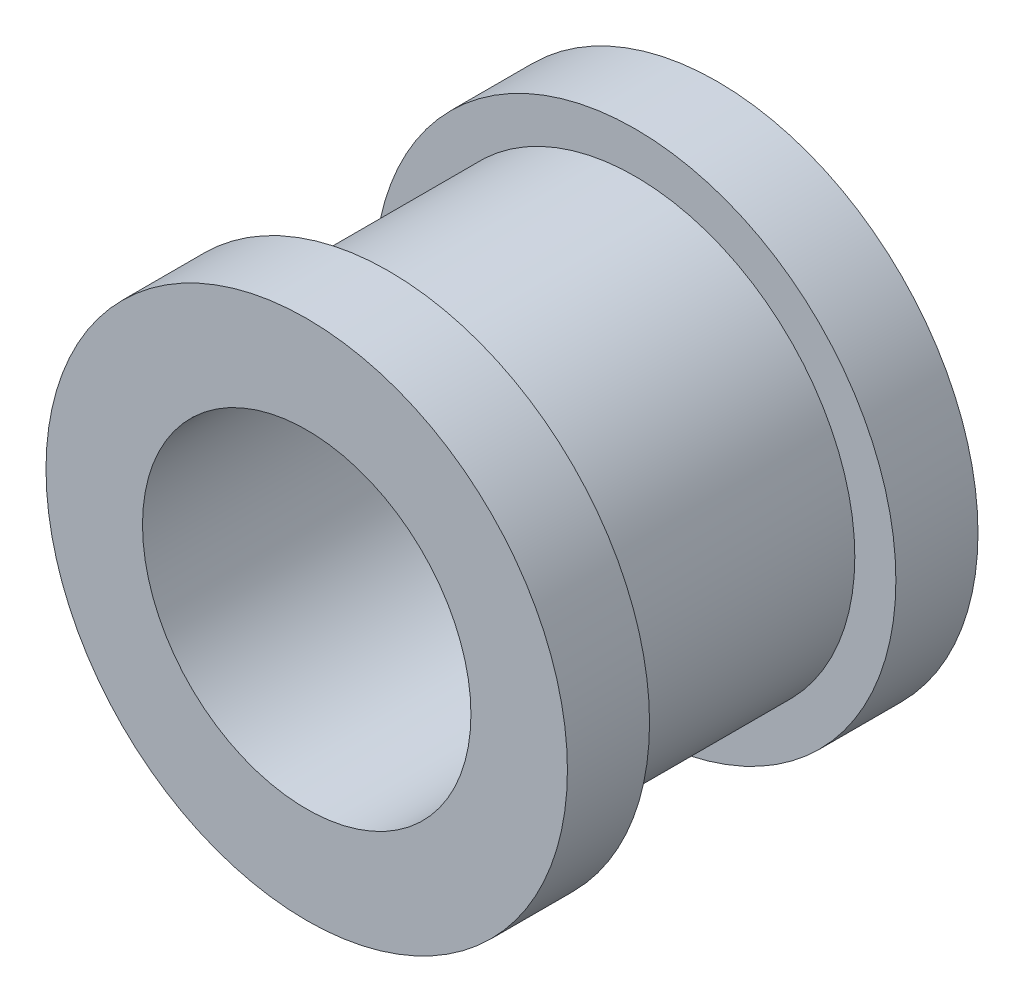
ISO-10303-21;
HEADER;
FILE_DESCRIPTION(('STEP AP214'),'2;1');
FILE_NAME('part.step','',(''),(''),'','','');
FILE_SCHEMA(('AUTOMOTIVE_DESIGN { 1 0 10303 214 1 1 1 1 }'));
ENDSEC;
DATA;
#1=APPLICATION_CONTEXT('core data for automotive mechanical design processes');
#2=APPLICATION_PROTOCOL_DEFINITION('international standard','automotive_design',2000,#1);
#3=PRODUCT_CONTEXT('',#1,'mechanical');
#4=PRODUCT('Part','Part','',(#3));
#5=PRODUCT_RELATED_PRODUCT_CATEGORY('part','',(#4));
#6=PRODUCT_DEFINITION_FORMATION('','',#4);
#7=PRODUCT_DEFINITION_CONTEXT('part definition',#1,'design');
#8=PRODUCT_DEFINITION('design','',#6,#7);
#9=PRODUCT_DEFINITION_SHAPE('','',#8);
#10=(LENGTH_UNIT() NAMED_UNIT(*) SI_UNIT(.MILLI.,.METRE.));
#11=(NAMED_UNIT(*) PLANE_ANGLE_UNIT() SI_UNIT($,.RADIAN.));
#12=(NAMED_UNIT(*) SI_UNIT($,.STERADIAN.) SOLID_ANGLE_UNIT());
#13=UNCERTAINTY_MEASURE_WITH_UNIT(LENGTH_MEASURE(1.E-05),#10,'distance_accuracy_value','');
#14=(GEOMETRIC_REPRESENTATION_CONTEXT(3) GLOBAL_UNCERTAINTY_ASSIGNED_CONTEXT((#13)) GLOBAL_UNIT_ASSIGNED_CONTEXT((#10,
#11,#12)) REPRESENTATION_CONTEXT('',''));
#15=CARTESIAN_POINT('',(0.,0.,0.));
#16=DIRECTION('',(0.,0.,1.));
#17=DIRECTION('',(1.,0.,0.));
#18=AXIS2_PLACEMENT_3D('',#15,#16,#17);
#19=CARTESIAN_POINT('',(0.,0.,10.));
#20=DIRECTION('',(0.,0.,-1.));
#21=DIRECTION('',(-1.,0.,0.));
#22=AXIS2_PLACEMENT_3D('',#19,#20,#21);
#23=CYLINDRICAL_SURFACE('',#22,6.35);
#24=CARTESIAN_POINT('',(0.,0.,0.));
#25=DIRECTION('',(0.,0.,1.));
#26=DIRECTION('',(1.,0.,0.));
#27=AXIS2_PLACEMENT_3D('',#24,#25,#26);
#28=CIRCLE('',#27,6.35);
#29=CARTESIAN_POINT('',(6.35,0.,0.));
#30=VERTEX_POINT('',#29);
#31=EDGE_CURVE('E34',#30,#30,#28,.T.);
#32=ORIENTED_EDGE('',*,*,#31,.T.);
#33=EDGE_LOOP('',(#32));
#34=FACE_BOUND('',#33,.T.);
#35=CARTESIAN_POINT('',(0.,0.,1.99999999999999));
#36=DIRECTION('',(0.,0.,1.));
#37=DIRECTION('',(1.,0.,0.));
#38=AXIS2_PLACEMENT_3D('',#35,#36,#37);
#39=CIRCLE('',#38,6.35);
#40=CARTESIAN_POINT('',(6.35,0.,1.99999999999999));
#41=VERTEX_POINT('',#40);
#42=EDGE_CURVE('E57',#41,#41,#39,.T.);
#43=ORIENTED_EDGE('',*,*,#42,.F.);
#44=EDGE_LOOP('',(#43));
#45=FACE_BOUND('',#44,.T.);
#46=ADVANCED_FACE('F31',(#34,#45),#23,.T.);
#47=CARTESIAN_POINT('',(0.,0.,10.));
#48=DIRECTION('',(0.,0.,1.));
#49=DIRECTION('',(1.,0.,0.));
#50=AXIS2_PLACEMENT_3D('',#47,#48,#49);
#51=CIRCLE('',#50,6.35);
#52=CARTESIAN_POINT('',(6.35,0.,10.));
#53=VERTEX_POINT('',#52);
#54=EDGE_CURVE('E10',#53,#53,#51,.T.);
#55=ORIENTED_EDGE('',*,*,#54,.F.);
#56=EDGE_LOOP('',(#55));
#57=FACE_BOUND('',#56,.T.);
#58=CARTESIAN_POINT('',(0.,0.,8.));
#59=DIRECTION('',(0.,0.,1.));
#60=DIRECTION('',(1.,0.,0.));
#61=AXIS2_PLACEMENT_3D('',#58,#59,#60);
#62=CIRCLE('',#61,6.35);
#63=CARTESIAN_POINT('',(6.35,0.,8.));
#64=VERTEX_POINT('',#63);
#65=EDGE_CURVE('E54',#64,#64,#62,.T.);
#66=ORIENTED_EDGE('',*,*,#65,.T.);
#67=EDGE_LOOP('',(#66));
#68=FACE_BOUND('',#67,.T.);
#69=ADVANCED_FACE('F65',(#57,#68),#23,.T.);
#70=CARTESIAN_POINT('',(0.,0.,10.));
#71=DIRECTION('',(0.,0.,1.));
#72=DIRECTION('',(1.,0.,0.));
#73=AXIS2_PLACEMENT_3D('',#70,#71,#72);
#74=PLANE('',#73);
#75=ORIENTED_EDGE('',*,*,#54,.T.);
#76=EDGE_LOOP('',(#75));
#77=FACE_BOUND('',#76,.T.);
#78=CARTESIAN_POINT('',(0.,0.,10.));
#79=DIRECTION('',(0.,0.,1.));
#80=DIRECTION('',(1.,0.,0.));
#81=AXIS2_PLACEMENT_3D('',#78,#79,#80);
#82=CIRCLE('',#81,4.);
#83=CARTESIAN_POINT('',(4.,0.,10.));
#84=VERTEX_POINT('',#83);
#85=EDGE_CURVE('E41',#84,#84,#82,.T.);
#86=ORIENTED_EDGE('',*,*,#85,.F.);
#87=EDGE_LOOP('',(#86));
#88=FACE_BOUND('',#87,.T.);
#89=ADVANCED_FACE('F70',(#77,#88),#74,.T.);
#90=CARTESIAN_POINT('',(0.,0.,0.));
#91=DIRECTION('',(0.,0.,1.));
#92=DIRECTION('',(1.,0.,0.));
#93=AXIS2_PLACEMENT_3D('',#90,#91,#92);
#94=PLANE('',#93);
#95=ORIENTED_EDGE('',*,*,#31,.F.);
#96=EDGE_LOOP('',(#95));
#97=FACE_BOUND('',#96,.T.);
#98=CARTESIAN_POINT('',(0.,0.,0.));
#99=DIRECTION('',(0.,0.,1.));
#100=DIRECTION('',(1.,0.,0.));
#101=AXIS2_PLACEMENT_3D('',#98,#99,#100);
#102=CIRCLE('',#101,4.);
#103=CARTESIAN_POINT('',(4.,0.,0.));
#104=VERTEX_POINT('',#103);
#105=EDGE_CURVE('E43',#104,#104,#102,.T.);
#106=ORIENTED_EDGE('',*,*,#105,.T.);
#107=EDGE_LOOP('',(#106));
#108=FACE_BOUND('',#107,.T.);
#109=ADVANCED_FACE('F74',(#97,#108),#94,.F.);
#110=CARTESIAN_POINT('',(0.,0.,10.));
#111=DIRECTION('',(0.,0.,-1.));
#112=DIRECTION('',(-1.,0.,0.));
#113=AXIS2_PLACEMENT_3D('',#110,#111,#112);
#114=CYLINDRICAL_SURFACE('',#113,4.);
#115=ORIENTED_EDGE('',*,*,#85,.T.);
#116=EDGE_LOOP('',(#115));
#117=FACE_BOUND('',#116,.T.);
#118=ORIENTED_EDGE('',*,*,#105,.F.);
#119=EDGE_LOOP('',(#118));
#120=FACE_BOUND('',#119,.T.);
#121=ADVANCED_FACE('F77',(#117,#120),#114,.F.);
#122=CARTESIAN_POINT('',(0.,6.35,2.));
#123=DIRECTION('',(0.,0.,1.));
#124=DIRECTION('',(1.,0.,0.));
#125=AXIS2_PLACEMENT_3D('',#122,#123,#124);
#126=PLANE('',#125);
#127=ORIENTED_EDGE('',*,*,#42,.T.);
#128=EDGE_LOOP('',(#127));
#129=FACE_BOUND('',#128,.T.);
#130=CARTESIAN_POINT('',(0.,0.,2.));
#131=DIRECTION('',(0.,0.,1.));
#132=DIRECTION('',(1.,0.,0.));
#133=AXIS2_PLACEMENT_3D('',#130,#131,#132);
#134=CIRCLE('',#133,5.35);
#135=CARTESIAN_POINT('',(5.35,0.,2.));
#136=VERTEX_POINT('',#135);
#137=EDGE_CURVE('E46',#136,#136,#134,.T.);
#138=ORIENTED_EDGE('',*,*,#137,.F.);
#139=EDGE_LOOP('',(#138));
#140=FACE_BOUND('',#139,.T.);
#141=ADVANCED_FACE('F61',(#129,#140),#126,.T.);
#142=CARTESIAN_POINT('',(0.,0.,10.));
#143=DIRECTION('',(0.,0.,1.));
#144=DIRECTION('',(1.,0.,0.));
#145=AXIS2_PLACEMENT_3D('',#142,#143,#144);
#146=CYLINDRICAL_SURFACE('',#145,5.35);
#147=ORIENTED_EDGE('',*,*,#137,.T.);
#148=EDGE_LOOP('',(#147));
#149=FACE_BOUND('',#148,.T.);
#150=CARTESIAN_POINT('',(0.,0.,8.));
#151=DIRECTION('',(0.,0.,1.));
#152=DIRECTION('',(1.,0.,0.));
#153=AXIS2_PLACEMENT_3D('',#150,#151,#152);
#154=CIRCLE('',#153,5.35);
#155=CARTESIAN_POINT('',(5.35,0.,8.));
#156=VERTEX_POINT('',#155);
#157=EDGE_CURVE('E51',#156,#156,#154,.T.);
#158=ORIENTED_EDGE('',*,*,#157,.F.);
#159=EDGE_LOOP('',(#158));
#160=FACE_BOUND('',#159,.T.);
#161=ADVANCED_FACE('F86',(#149,#160),#146,.T.);
#162=CARTESIAN_POINT('',(0.,6.35,8.));
#163=DIRECTION('',(0.,0.,-1.));
#164=DIRECTION('',(-1.,0.,0.));
#165=AXIS2_PLACEMENT_3D('',#162,#163,#164);
#166=PLANE('',#165);
#167=ORIENTED_EDGE('',*,*,#157,.T.);
#168=EDGE_LOOP('',(#167));
#169=FACE_BOUND('',#168,.T.);
#170=ORIENTED_EDGE('',*,*,#65,.F.);
#171=EDGE_LOOP('',(#170));
#172=FACE_BOUND('',#171,.T.);
#173=ADVANCED_FACE('F128',(#169,#172),#166,.T.);
#174=CLOSED_SHELL('',(#46,#69,#89,#109,#121,#141,#161,#173));
#175=MANIFOLD_SOLID_BREP('B2',#174);
#176=ADVANCED_BREP_SHAPE_REPRESENTATION('',(#18,#175),#14);
#177=SHAPE_DEFINITION_REPRESENTATION(#9,#176);
ENDSEC;
END-ISO-10303-21;
